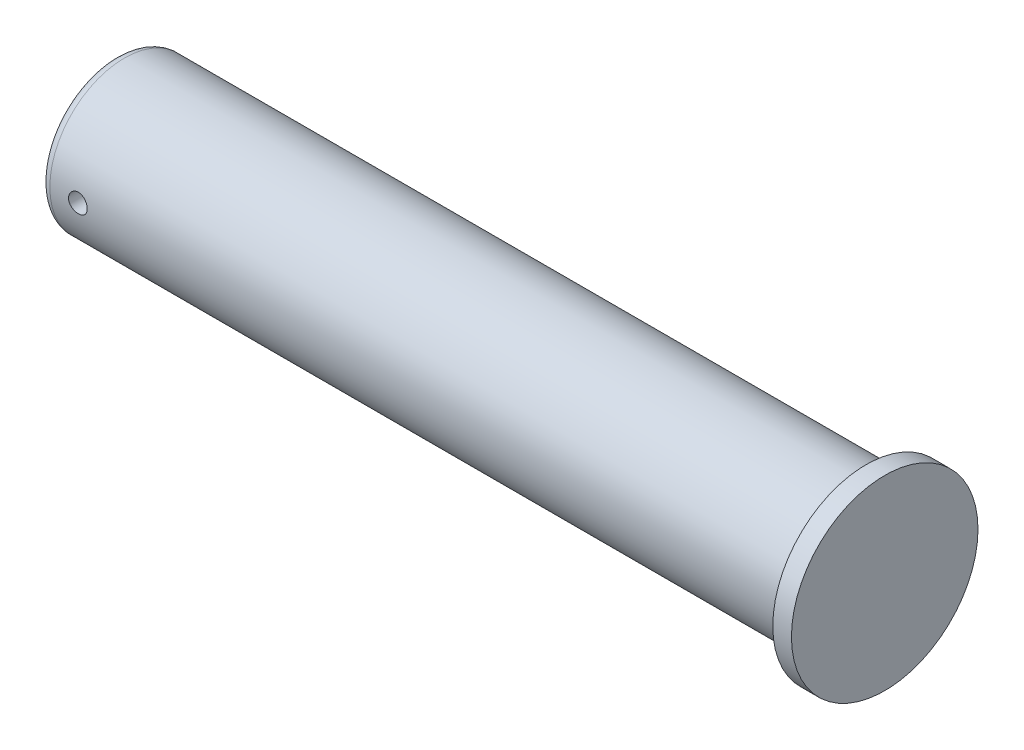
ISO-10303-21;
HEADER;
FILE_DESCRIPTION(('STEP AP214'),'2;1');
FILE_NAME('part.step','',(''),(''),'','','');
FILE_SCHEMA(('AUTOMOTIVE_DESIGN { 1 0 10303 214 1 1 1 1 }'));
ENDSEC;
DATA;
#1=APPLICATION_CONTEXT('core data for automotive mechanical design processes');
#2=APPLICATION_PROTOCOL_DEFINITION('international standard','automotive_design',2000,#1);
#3=PRODUCT_CONTEXT('',#1,'mechanical');
#4=PRODUCT('Part','Part','',(#3));
#5=PRODUCT_RELATED_PRODUCT_CATEGORY('part','',(#4));
#6=PRODUCT_DEFINITION_FORMATION('','',#4);
#7=PRODUCT_DEFINITION_CONTEXT('part definition',#1,'design');
#8=PRODUCT_DEFINITION('design','',#6,#7);
#9=PRODUCT_DEFINITION_SHAPE('','',#8);
#10=(LENGTH_UNIT() NAMED_UNIT(*) SI_UNIT(.MILLI.,.METRE.));
#11=(NAMED_UNIT(*) PLANE_ANGLE_UNIT() SI_UNIT($,.RADIAN.));
#12=(NAMED_UNIT(*) SI_UNIT($,.STERADIAN.) SOLID_ANGLE_UNIT());
#13=UNCERTAINTY_MEASURE_WITH_UNIT(LENGTH_MEASURE(1.E-05),#10,'distance_accuracy_value','');
#14=(GEOMETRIC_REPRESENTATION_CONTEXT(3) GLOBAL_UNCERTAINTY_ASSIGNED_CONTEXT((#13)) GLOBAL_UNIT_ASSIGNED_CONTEXT((#10,
#11,#12)) REPRESENTATION_CONTEXT('',''));
#15=CARTESIAN_POINT('',(0.,0.,0.));
#16=DIRECTION('',(0.,0.,1.));
#17=DIRECTION('',(1.,0.,0.));
#18=AXIS2_PLACEMENT_3D('',#15,#16,#17);
#19=CARTESIAN_POINT('',(-15.9565882116665,0.,0.));
#20=DIRECTION('',(-1.,0.,0.));
#21=DIRECTION('',(0.,0.,1.));
#22=AXIS2_PLACEMENT_3D('',#19,#20,#21);
#23=CYLINDRICAL_SURFACE('',#22,8.);
#24=CARTESIAN_POINT('',(1.,0.,0.));
#25=DIRECTION('',(1.,0.,0.));
#26=DIRECTION('',(0.,0.,-1.));
#27=AXIS2_PLACEMENT_3D('',#24,#25,#26);
#28=CIRCLE('',#27,8.);
#29=CARTESIAN_POINT('',(1.,0.,-8.));
#30=VERTEX_POINT('',#29);
#31=EDGE_CURVE('E12',#30,#30,#28,.T.);
#32=ORIENTED_EDGE('',*,*,#31,.T.);
#33=EDGE_LOOP('',(#32));
#34=FACE_BOUND('',#33,.T.);
#35=CARTESIAN_POINT('',(80.5,0.,0.));
#36=DIRECTION('',(-1.,0.,0.));
#37=DIRECTION('',(0.,0.,1.));
#38=AXIS2_PLACEMENT_3D('',#35,#36,#37);
#39=CIRCLE('',#38,8.);
#40=CARTESIAN_POINT('',(80.5,0.,8.));
#41=VERTEX_POINT('',#40);
#42=EDGE_CURVE('E56',#41,#41,#39,.T.);
#43=ORIENTED_EDGE('',*,*,#42,.T.);
#44=EDGE_LOOP('',(#43));
#45=FACE_BOUND('',#44,.T.);
#46=CARTESIAN_POINT('',(5.,0.,-8.));
#47=CARTESIAN_POINT('',(4.99999762362571,-0.0559364382223046,-7.99999921958571));
#48=CARTESIAN_POINT('',(4.99529084833229,-0.111907829721099,-7.99940713821961));
#49=CARTESIAN_POINT('',(4.97658889817168,-0.222293120835901,-7.99710216044544));
#50=CARTESIAN_POINT('',(4.96258402483064,-0.276705332249498,-7.99538809376571));
#51=CARTESIAN_POINT('',(4.92570494243437,-0.382358229925222,-7.99103224417762));
#52=CARTESIAN_POINT('',(4.90283670327606,-0.433601024058455,-7.98839108582217));
#53=CARTESIAN_POINT('',(4.84889308641208,-0.531511789957214,-7.98247480351239));
#54=CARTESIAN_POINT('',(4.81781911658771,-0.578180544622548,-7.97919978833646));
#55=CARTESIAN_POINT('',(4.74816322006416,-0.665885126772526,-7.9723612852253));
#56=CARTESIAN_POINT('',(4.7095451482615,-0.70689214597485,-7.96879645876967));
#57=CARTESIAN_POINT('',(4.62597487058534,-0.781861117422997,-7.961790904039));
#58=CARTESIAN_POINT('',(4.5810223420347,-0.8158227105569,-7.95835018209707));
#59=CARTESIAN_POINT('',(4.48587200897373,-0.875844064513576,-7.95196922247834));
#60=CARTESIAN_POINT('',(4.43565705537282,-0.901876838376429,-7.94903070871164));
#61=CARTESIAN_POINT('',(4.33152517922106,-0.945129230630047,-7.94400451383073));
#62=CARTESIAN_POINT('',(4.27760839714119,-0.962349183226086,-7.94191680045254));
#63=CARTESIAN_POINT('',(4.16790232176529,-0.987399592009905,-7.93884135841445));
#64=CARTESIAN_POINT('',(4.11212429691832,-0.99527868589268,-7.93784793374698));
#65=CARTESIAN_POINT('',(4.00002949461127,-1.00157421982289,-7.93705611257117));
#66=CARTESIAN_POINT('',(3.94371273890748,-0.999991040400966,-7.93725766800603));
#67=CARTESIAN_POINT('',(3.83247806910049,-0.987446894579161,-7.93882782147901));
#68=CARTESIAN_POINT('',(3.77755400551989,-0.976539505193878,-7.94018975184131));
#69=CARTESIAN_POINT('',(3.67032199151241,-0.94574015327282,-7.94391679903051));
#70=CARTESIAN_POINT('',(3.61801409411438,-0.925848008700761,-7.94628193618289));
#71=CARTESIAN_POINT('',(3.51733280039133,-0.87758622396466,-7.9517564634586));
#72=CARTESIAN_POINT('',(3.46897067990041,-0.849193301483054,-7.95486789284578));
#73=CARTESIAN_POINT('',(3.3776773222347,-0.784752587782767,-7.96148284572239));
#74=CARTESIAN_POINT('',(3.33474633361053,-0.74870444643231,-7.96498638714265));
#75=CARTESIAN_POINT('',(3.2552229157109,-0.669679644301512,-7.9720204395617));
#76=CARTESIAN_POINT('',(3.21867636329361,-0.626656803136004,-7.97555096954756));
#77=CARTESIAN_POINT('',(3.15331644798778,-0.535062867645569,-7.98221853022341));
#78=CARTESIAN_POINT('',(3.1245031029312,-0.4864917605273,-7.98535556000602));
#79=CARTESIAN_POINT('',(3.07542747181443,-0.385144668545392,-7.99088460887432));
#80=CARTESIAN_POINT('',(3.05516805844751,-0.332367278135086,-7.99327637760615));
#81=CARTESIAN_POINT('',(3.0238118025907,-0.224123176172422,-7.99704314312025));
#82=CARTESIAN_POINT('',(3.01271453114518,-0.168656590652266,-7.99841818750348));
#83=CARTESIAN_POINT('',(3.00005703029578,-0.0570052655653986,-7.99999038564304));
#84=CARTESIAN_POINT('',(2.99843360305437,-0.000827796079442632,-8.00019534457054));
#85=CARTESIAN_POINT('',(3.00460309362238,0.110998414598999,-7.99942535202172));
#86=CARTESIAN_POINT('',(3.01239581090064,0.166647167025883,-7.99845042567285));
#87=CARTESIAN_POINT('',(3.03712388350975,0.275649803088609,-7.99543507502677));
#88=CARTESIAN_POINT('',(3.05402910536105,0.329010628169882,-7.99339816325548));
#89=CARTESIAN_POINT('',(3.09647098076517,0.432139861943363,-7.98848689240079));
#90=CARTESIAN_POINT('',(3.12200792739657,0.481908148586126,-7.98561250488249));
#91=CARTESIAN_POINT('',(3.18114125500298,0.576721808274971,-7.97932729164045));
#92=CARTESIAN_POINT('',(3.21477851592225,0.621741503977528,-7.97591377617004));
#93=CARTESIAN_POINT('',(3.28909979901368,0.705518795850527,-7.96894056930262));
#94=CARTESIAN_POINT('',(3.3297841009004,0.744276143334743,-7.96538087210759));
#95=CARTESIAN_POINT('',(3.41732296670286,0.814652783527207,-7.95849242185034));
#96=CARTESIAN_POINT('',(3.46421133852416,0.846230184227173,-7.9551650988853));
#97=CARTESIAN_POINT('',(3.56266329794189,0.901061155777402,-7.94914164414859));
#98=CARTESIAN_POINT('',(3.61422679179061,0.924314893491347,-7.94644549972411));
#99=CARTESIAN_POINT('',(3.72043012765905,0.961770631546616,-7.94199940157198));
#100=CARTESIAN_POINT('',(3.77506153201919,0.975996250982843,-7.94024698073915));
#101=CARTESIAN_POINT('',(3.88596099351227,0.995067997547138,-7.93787966362982));
#102=CARTESIAN_POINT('',(3.9422289743836,0.999914561014305,-7.93726471443511));
#103=CARTESIAN_POINT('',(4.05438757168187,1.00008261443393,-7.93724350792982));
#104=CARTESIAN_POINT('',(4.11027809933276,0.995469919079709,-7.93782889900781));
#105=CARTESIAN_POINT('',(4.22048285173803,0.97698976193973,-7.94012445814881));
#106=CARTESIAN_POINT('',(4.27479707632352,0.963122299162307,-7.94183462633232));
#107=CARTESIAN_POINT('',(4.38029878270656,0.926546829475862,-7.9461844630982));
#108=CARTESIAN_POINT('',(4.43148737800873,0.903841992388373,-7.94882379837113));
#109=CARTESIAN_POINT('',(4.52933866161933,0.850242760860123,-7.95473513297927));
#110=CARTESIAN_POINT('',(4.57600129320793,0.819348263803835,-7.95800714024165));
#111=CARTESIAN_POINT('',(4.66381249013619,0.750002532506335,-7.96484241900893));
#112=CARTESIAN_POINT('',(4.70492218438199,0.711502250309983,-7.96840748833613));
#113=CARTESIAN_POINT('',(4.78012273006719,0.628140090787353,-7.9754113263716));
#114=CARTESIAN_POINT('',(4.81421192430972,0.583276715656627,-7.97885006510236));
#115=CARTESIAN_POINT('',(4.87451414284212,0.488266248341684,-7.98522822634699));
#116=CARTESIAN_POINT('',(4.9006967223597,0.438099711838468,-7.9881657003132));
#117=CARTESIAN_POINT('',(4.94422849716651,0.334073160920512,-7.9931905963069));
#118=CARTESIAN_POINT('',(4.96158729054138,0.280217232348094,-7.9952789414783));
#119=CARTESIAN_POINT('',(4.98282373526852,0.18840230878717,-7.99786688131099));
#120=CARTESIAN_POINT('',(4.98925557679283,0.151022265406768,-7.99866290358181));
#121=CARTESIAN_POINT('',(4.99784449827729,0.0757668252849738,-7.99972972531675));
#122=CARTESIAN_POINT('',(5.00000160975972,0.0378914321984109,-8.00000052865388));
#123=CARTESIAN_POINT('',(5.,0.,-8.));
#124=B_SPLINE_CURVE_WITH_KNOTS('',3,(#46,#47,#48,#49,#50,#51,#52,#53,#54,#55,#56,#57,#58,#59,
#60,#61,#62,#63,#64,#65,#66,#67,#68,#69,#70,#71,#72,#73,#74,#75,#76,#77,#78,#79,#80,#81,#82,#83,
#84,#85,#86,#87,#88,#89,#90,#91,#92,#93,#94,#95,#96,#97,#98,#99,#100,#101,#102,#103,#104,#105,
#106,#107,#108,#109,#110,#111,#112,#113,#114,#115,#116,#117,#118,#119,#120,#121,#122,#123),
.UNSPECIFIED.,.T.,.F.,(4,2,2,2,2,2,2,2,2,2,2,2,2,2,2,2,2,2,2,2,2,2,2,2,2,2,2,2,2,2,2,2,2,2,2,2,
2,2,4),(0.,0.167670909110499,0.335516984377371,0.503250203272708,0.670954662364292,
0.839483252807372,1.00802043120004,1.17712500127548,1.34622315798723,1.51443690114528,
1.68264387953865,1.84989078576677,2.01714108066497,2.18485370514213,2.35257400205455,
2.52145391254567,2.69033421245245,2.85927118292642,3.02820024361512,3.19600111756768,
3.36379841800771,3.53104421557358,3.69829569231579,3.86640961171369,4.03453020550035,
4.20360788603029,4.37268217688615,4.5413122971237,4.70993457204249,4.87738760480886,
5.04484065551819,5.21223369882595,5.37962883964906,5.54814095076732,5.71669279388005,
5.88588561214741,6.05489399473613,6.16847537275051,6.28205591320175),.UNSPECIFIED.);
#125=CARTESIAN_POINT('',(5.,0.,-8.));
#126=VERTEX_POINT('',#125);
#127=EDGE_CURVE('E71',#126,#126,#124,.T.);
#128=ORIENTED_EDGE('',*,*,#127,.F.);
#129=EDGE_LOOP('',(#128));
#130=FACE_BOUND('',#129,.T.);
#131=CARTESIAN_POINT('',(5.,0.,8.));
#132=CARTESIAN_POINT('',(4.99999762362571,0.0559364382223046,7.99999921958571));
#133=CARTESIAN_POINT('',(4.99529084833229,0.111907829721099,7.99940713821961));
#134=CARTESIAN_POINT('',(4.97658889817168,0.222293120835901,7.99710216044544));
#135=CARTESIAN_POINT('',(4.96258402483064,0.276705332249498,7.99538809376571));
#136=CARTESIAN_POINT('',(4.92570494243437,0.382358229925222,7.99103224417762));
#137=CARTESIAN_POINT('',(4.90283670327606,0.433601024058455,7.98839108582217));
#138=CARTESIAN_POINT('',(4.84889308641208,0.531511789957214,7.98247480351239));
#139=CARTESIAN_POINT('',(4.81781911658771,0.578180544622548,7.97919978833646));
#140=CARTESIAN_POINT('',(4.74816322006416,0.665885126772526,7.9723612852253));
#141=CARTESIAN_POINT('',(4.7095451482615,0.70689214597485,7.96879645876967));
#142=CARTESIAN_POINT('',(4.62597487058534,0.781861117422997,7.961790904039));
#143=CARTESIAN_POINT('',(4.5810223420347,0.8158227105569,7.95835018209707));
#144=CARTESIAN_POINT('',(4.48587200897373,0.875844064513576,7.95196922247834));
#145=CARTESIAN_POINT('',(4.43565705537282,0.901876838376429,7.94903070871164));
#146=CARTESIAN_POINT('',(4.33152517922106,0.945129230630047,7.94400451383073));
#147=CARTESIAN_POINT('',(4.27760839714119,0.962349183226086,7.94191680045254));
#148=CARTESIAN_POINT('',(4.16790232176529,0.987399592009905,7.93884135841445));
#149=CARTESIAN_POINT('',(4.11212429691832,0.99527868589268,7.93784793374698));
#150=CARTESIAN_POINT('',(4.00002949461127,1.00157421982289,7.93705611257117));
#151=CARTESIAN_POINT('',(3.94371273890748,0.999991040400966,7.93725766800603));
#152=CARTESIAN_POINT('',(3.83247806910049,0.987446894579161,7.93882782147901));
#153=CARTESIAN_POINT('',(3.77755400551989,0.976539505193878,7.94018975184131));
#154=CARTESIAN_POINT('',(3.67032199151241,0.94574015327282,7.94391679903051));
#155=CARTESIAN_POINT('',(3.61801409411438,0.925848008700761,7.94628193618289));
#156=CARTESIAN_POINT('',(3.51733280039133,0.87758622396466,7.9517564634586));
#157=CARTESIAN_POINT('',(3.46897067990041,0.849193301483054,7.95486789284578));
#158=CARTESIAN_POINT('',(3.3776773222347,0.784752587782767,7.96148284572239));
#159=CARTESIAN_POINT('',(3.33474633361053,0.74870444643231,7.96498638714265));
#160=CARTESIAN_POINT('',(3.2552229157109,0.669679644301512,7.9720204395617));
#161=CARTESIAN_POINT('',(3.21867636329361,0.626656803136004,7.97555096954756));
#162=CARTESIAN_POINT('',(3.15331644798778,0.535062867645569,7.98221853022341));
#163=CARTESIAN_POINT('',(3.1245031029312,0.4864917605273,7.98535556000602));
#164=CARTESIAN_POINT('',(3.07542747181443,0.385144668545392,7.99088460887432));
#165=CARTESIAN_POINT('',(3.05516805844751,0.332367278135086,7.99327637760615));
#166=CARTESIAN_POINT('',(3.0238118025907,0.224123176172422,7.99704314312025));
#167=CARTESIAN_POINT('',(3.01271453114518,0.168656590652266,7.99841818750348));
#168=CARTESIAN_POINT('',(3.00005703029578,0.0570052655653986,7.99999038564304));
#169=CARTESIAN_POINT('',(2.99843360305437,0.000827796079442632,8.00019534457054));
#170=CARTESIAN_POINT('',(3.00460309362238,-0.110998414598999,7.99942535202172));
#171=CARTESIAN_POINT('',(3.01239581090064,-0.166647167025883,7.99845042567285));
#172=CARTESIAN_POINT('',(3.03712388350975,-0.275649803088609,7.99543507502677));
#173=CARTESIAN_POINT('',(3.05402910536105,-0.329010628169882,7.99339816325548));
#174=CARTESIAN_POINT('',(3.09647098076517,-0.432139861943363,7.98848689240079));
#175=CARTESIAN_POINT('',(3.12200792739657,-0.481908148586126,7.98561250488249));
#176=CARTESIAN_POINT('',(3.18114125500298,-0.576721808274971,7.97932729164045));
#177=CARTESIAN_POINT('',(3.21477851592225,-0.621741503977528,7.97591377617004));
#178=CARTESIAN_POINT('',(3.28909979901368,-0.705518795850527,7.96894056930262));
#179=CARTESIAN_POINT('',(3.3297841009004,-0.744276143334743,7.96538087210759));
#180=CARTESIAN_POINT('',(3.41732296670286,-0.814652783527207,7.95849242185034));
#181=CARTESIAN_POINT('',(3.46421133852416,-0.846230184227173,7.9551650988853));
#182=CARTESIAN_POINT('',(3.56266329794189,-0.901061155777402,7.94914164414859));
#183=CARTESIAN_POINT('',(3.61422679179061,-0.924314893491347,7.94644549972411));
#184=CARTESIAN_POINT('',(3.72043012765905,-0.961770631546616,7.94199940157198));
#185=CARTESIAN_POINT('',(3.77506153201919,-0.975996250982843,7.94024698073915));
#186=CARTESIAN_POINT('',(3.88596099351227,-0.995067997547138,7.93787966362982));
#187=CARTESIAN_POINT('',(3.9422289743836,-0.999914561014305,7.93726471443511));
#188=CARTESIAN_POINT('',(4.05438757168187,-1.00008261443393,7.93724350792982));
#189=CARTESIAN_POINT('',(4.11027809933276,-0.995469919079709,7.93782889900781));
#190=CARTESIAN_POINT('',(4.22048285173803,-0.97698976193973,7.94012445814881));
#191=CARTESIAN_POINT('',(4.27479707632352,-0.963122299162307,7.94183462633232));
#192=CARTESIAN_POINT('',(4.38029878270656,-0.926546829475862,7.9461844630982));
#193=CARTESIAN_POINT('',(4.43148737800873,-0.903841992388373,7.94882379837113));
#194=CARTESIAN_POINT('',(4.52933866161933,-0.850242760860123,7.95473513297927));
#195=CARTESIAN_POINT('',(4.57600129320793,-0.819348263803835,7.95800714024165));
#196=CARTESIAN_POINT('',(4.66381249013619,-0.750002532506335,7.96484241900893));
#197=CARTESIAN_POINT('',(4.70492218438199,-0.711502250309983,7.96840748833613));
#198=CARTESIAN_POINT('',(4.78012273006719,-0.628140090787353,7.9754113263716));
#199=CARTESIAN_POINT('',(4.81421192430972,-0.583276715656627,7.97885006510236));
#200=CARTESIAN_POINT('',(4.87451414284212,-0.488266248341684,7.98522822634699));
#201=CARTESIAN_POINT('',(4.9006967223597,-0.438099711838468,7.9881657003132));
#202=CARTESIAN_POINT('',(4.94422849716651,-0.334073160920512,7.9931905963069));
#203=CARTESIAN_POINT('',(4.96158729054138,-0.280217232348094,7.9952789414783));
#204=CARTESIAN_POINT('',(4.98282373526852,-0.18840230878717,7.99786688131099));
#205=CARTESIAN_POINT('',(4.98925557679283,-0.151022265406768,7.99866290358181));
#206=CARTESIAN_POINT('',(4.99784449827729,-0.0757668252849738,7.99972972531675));
#207=CARTESIAN_POINT('',(5.00000160975972,-0.0378914321984109,8.00000052865388));
#208=CARTESIAN_POINT('',(5.,0.,8.));
#209=B_SPLINE_CURVE_WITH_KNOTS('',3,(#131,#132,#133,#134,#135,#136,#137,#138,#139,#140,#141,
#142,#143,#144,#145,#146,#147,#148,#149,#150,#151,#152,#153,#154,#155,#156,#157,#158,#159,#160,
#161,#162,#163,#164,#165,#166,#167,#168,#169,#170,#171,#172,#173,#174,#175,#176,#177,#178,#179,
#180,#181,#182,#183,#184,#185,#186,#187,#188,#189,#190,#191,#192,#193,#194,#195,#196,#197,#198,
#199,#200,#201,#202,#203,#204,#205,#206,#207,#208),.UNSPECIFIED.,.T.,.F.,(4,2,2,2,2,2,2,2,2,2,2,
2,2,2,2,2,2,2,2,2,2,2,2,2,2,2,2,2,2,2,2,2,2,2,2,2,2,2,4),(0.,0.167670909110499,
0.335516984377371,0.503250203272708,0.670954662364292,0.839483252807372,1.00802043120004,
1.17712500127548,1.34622315798723,1.51443690114528,1.68264387953865,1.84989078576677,
2.01714108066497,2.18485370514213,2.35257400205455,2.52145391254567,2.69033421245245,
2.85927118292642,3.02820024361512,3.19600111756768,3.36379841800771,3.53104421557358,
3.69829569231579,3.86640961171369,4.03453020550035,4.20360788603029,4.37268217688615,
4.5413122971237,4.70993457204249,4.87738760480886,5.04484065551819,5.21223369882595,
5.37962883964906,5.54814095076732,5.71669279388005,5.88588561214741,6.05489399473613,
6.16847537275051,6.28205591320175),.UNSPECIFIED.);
#210=CARTESIAN_POINT('',(5.,0.,8.));
#211=VERTEX_POINT('',#210);
#212=EDGE_CURVE('E63',#211,#211,#209,.T.);
#213=ORIENTED_EDGE('',*,*,#212,.F.);
#214=EDGE_LOOP('',(#213));
#215=FACE_BOUND('',#214,.T.);
#216=ADVANCED_FACE('F45',(#34,#45,#130,#215),#23,.T.);
#217=CARTESIAN_POINT('',(0.,0.,0.));
#218=DIRECTION('',(1.,0.,0.));
#219=DIRECTION('',(0.,0.,-1.));
#220=AXIS2_PLACEMENT_3D('',#217,#218,#219);
#221=PLANE('',#220);
#222=CARTESIAN_POINT('',(0.,0.,0.));
#223=DIRECTION('',(1.,0.,0.));
#224=DIRECTION('',(0.,0.,-1.));
#225=AXIS2_PLACEMENT_3D('',#222,#223,#224);
#226=CIRCLE('',#225,7.);
#227=CARTESIAN_POINT('',(0.,0.,-7.));
#228=VERTEX_POINT('',#227);
#229=EDGE_CURVE('E52',#228,#228,#226,.F.);
#230=ORIENTED_EDGE('',*,*,#229,.T.);
#231=EDGE_LOOP('',(#230));
#232=FACE_BOUND('',#231,.T.);
#233=ADVANCED_FACE('F92',(#232),#221,.F.);
#234=CARTESIAN_POINT('',(80.5,8.,0.));
#235=DIRECTION('',(1.,0.,0.));
#236=DIRECTION('',(0.,0.,-1.));
#237=AXIS2_PLACEMENT_3D('',#234,#235,#236);
#238=PLANE('',#237);
#239=ORIENTED_EDGE('',*,*,#42,.F.);
#240=EDGE_LOOP('',(#239));
#241=FACE_BOUND('',#240,.T.);
#242=CARTESIAN_POINT('',(80.5,0.,0.));
#243=DIRECTION('',(-1.,0.,0.));
#244=DIRECTION('',(0.,0.,1.));
#245=AXIS2_PLACEMENT_3D('',#242,#243,#244);
#246=CIRCLE('',#245,10.);
#247=CARTESIAN_POINT('',(80.5,0.,10.));
#248=VERTEX_POINT('',#247);
#249=EDGE_CURVE('E60',#248,#248,#246,.T.);
#250=ORIENTED_EDGE('',*,*,#249,.T.);
#251=EDGE_LOOP('',(#250));
#252=FACE_BOUND('',#251,.T.);
#253=ADVANCED_FACE('F89',(#241,#252),#238,.F.);
#254=CARTESIAN_POINT('',(-15.9565882116665,0.,0.));
#255=DIRECTION('',(-1.,0.,0.));
#256=DIRECTION('',(0.,0.,1.));
#257=AXIS2_PLACEMENT_3D('',#254,#255,#256);
#258=CYLINDRICAL_SURFACE('',#257,10.);
#259=ORIENTED_EDGE('',*,*,#249,.F.);
#260=EDGE_LOOP('',(#259));
#261=FACE_BOUND('',#260,.T.);
#262=CARTESIAN_POINT('',(82.5,0.,0.));
#263=DIRECTION('',(-1.,0.,0.));
#264=DIRECTION('',(0.,0.,1.));
#265=AXIS2_PLACEMENT_3D('',#262,#263,#264);
#266=CIRCLE('',#265,10.);
#267=CARTESIAN_POINT('',(82.5,0.,10.));
#268=VERTEX_POINT('',#267);
#269=EDGE_CURVE('E70',#268,#268,#266,.T.);
#270=ORIENTED_EDGE('',*,*,#269,.T.);
#271=EDGE_LOOP('',(#270));
#272=FACE_BOUND('',#271,.T.);
#273=ADVANCED_FACE('F86',(#261,#272),#258,.T.);
#274=CARTESIAN_POINT('',(82.5,10.,0.));
#275=DIRECTION('',(-1.,0.,0.));
#276=DIRECTION('',(0.,0.,1.));
#277=AXIS2_PLACEMENT_3D('',#274,#275,#276);
#278=PLANE('',#277);
#279=ORIENTED_EDGE('',*,*,#269,.F.);
#280=EDGE_LOOP('',(#279));
#281=FACE_BOUND('',#280,.T.);
#282=ADVANCED_FACE('F80',(#281),#278,.F.);
#283=CARTESIAN_POINT('',(4.,0.,10.));
#284=DIRECTION('',(0.,0.,-1.));
#285=DIRECTION('',(-1.,0.,0.));
#286=AXIS2_PLACEMENT_3D('',#283,#284,#285);
#287=CYLINDRICAL_SURFACE('',#286,1.);
#288=ORIENTED_EDGE('',*,*,#127,.T.);
#289=EDGE_LOOP('',(#288));
#290=FACE_BOUND('',#289,.T.);
#291=ORIENTED_EDGE('',*,*,#212,.T.);
#292=EDGE_LOOP('',(#291));
#293=FACE_BOUND('',#292,.T.);
#294=ADVANCED_FACE('F75',(#290,#293),#287,.F.);
#295=CARTESIAN_POINT('',(1.,0.,0.));
#296=DIRECTION('',(1.,0.,0.));
#297=DIRECTION('',(0.,0.,-1.));
#298=AXIS2_PLACEMENT_3D('',#295,#296,#297);
#299=TOROIDAL_SURFACE('',#298,7.,1.);
#300=ORIENTED_EDGE('',*,*,#31,.F.);
#301=EDGE_LOOP('',(#300));
#302=FACE_BOUND('',#301,.T.);
#303=ORIENTED_EDGE('',*,*,#229,.F.);
#304=EDGE_LOOP('',(#303));
#305=FACE_BOUND('',#304,.T.);
#306=ADVANCED_FACE('F47',(#302,#305),#299,.T.);
#307=CLOSED_SHELL('',(#216,#233,#253,#273,#282,#294,#306));
#308=MANIFOLD_SOLID_BREP('B2',#307);
#309=ADVANCED_BREP_SHAPE_REPRESENTATION('',(#18,#308),#14);
#310=SHAPE_DEFINITION_REPRESENTATION(#9,#309);
ENDSEC;
END-ISO-10303-21;
